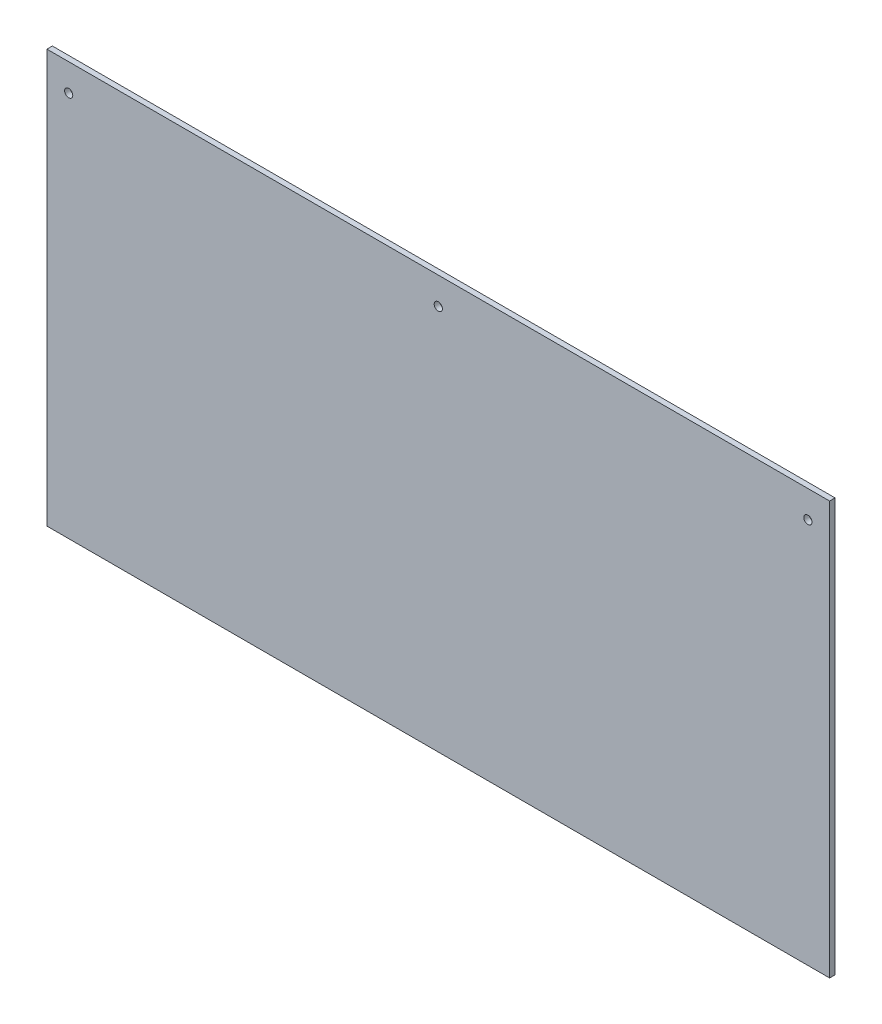
ISO-10303-21;
HEADER;
FILE_DESCRIPTION(('STEP AP214'),'2;1');
FILE_NAME('part.step','',(''),(''),'','','');
FILE_SCHEMA(('AUTOMOTIVE_DESIGN { 1 0 10303 214 1 1 1 1 }'));
ENDSEC;
DATA;
#1=APPLICATION_CONTEXT('core data for automotive mechanical design processes');
#2=APPLICATION_PROTOCOL_DEFINITION('international standard','automotive_design',2000,#1);
#3=PRODUCT_CONTEXT('',#1,'mechanical');
#4=PRODUCT('Part','Part','',(#3));
#5=PRODUCT_RELATED_PRODUCT_CATEGORY('part','',(#4));
#6=PRODUCT_DEFINITION_FORMATION('','',#4);
#7=PRODUCT_DEFINITION_CONTEXT('part definition',#1,'design');
#8=PRODUCT_DEFINITION('design','',#6,#7);
#9=PRODUCT_DEFINITION_SHAPE('','',#8);
#10=(LENGTH_UNIT() NAMED_UNIT(*) SI_UNIT(.MILLI.,.METRE.));
#11=(NAMED_UNIT(*) PLANE_ANGLE_UNIT() SI_UNIT($,.RADIAN.));
#12=(NAMED_UNIT(*) SI_UNIT($,.STERADIAN.) SOLID_ANGLE_UNIT());
#13=UNCERTAINTY_MEASURE_WITH_UNIT(LENGTH_MEASURE(1.E-05),#10,'distance_accuracy_value','');
#14=(GEOMETRIC_REPRESENTATION_CONTEXT(3) GLOBAL_UNCERTAINTY_ASSIGNED_CONTEXT((#13)) GLOBAL_UNIT_ASSIGNED_CONTEXT((#10,
#11,#12)) REPRESENTATION_CONTEXT('',''));
#15=CARTESIAN_POINT('',(0.,0.,0.));
#16=DIRECTION('',(0.,0.,1.));
#17=DIRECTION('',(1.,0.,0.));
#18=AXIS2_PLACEMENT_3D('',#15,#16,#17);
#19=CARTESIAN_POINT('',(889.,450.85,0.));
#20=DIRECTION('',(0.,0.,1.));
#21=DIRECTION('',(1.,0.,0.));
#22=AXIS2_PLACEMENT_3D('',#19,#20,#21);
#23=CYLINDRICAL_SURFACE('',#22,4.7625);
#24=CARTESIAN_POINT('',(889.,450.85,0.));
#25=DIRECTION('',(0.,0.,1.));
#26=DIRECTION('',(1.,0.,0.));
#27=AXIS2_PLACEMENT_3D('',#24,#25,#26);
#28=CIRCLE('',#27,4.7625);
#29=CARTESIAN_POINT('',(893.7625,450.85,0.));
#30=VERTEX_POINT('',#29);
#31=EDGE_CURVE('E42',#30,#30,#28,.T.);
#32=ORIENTED_EDGE('',*,*,#31,.F.);
#33=EDGE_LOOP('',(#32));
#34=FACE_BOUND('',#33,.T.);
#35=CARTESIAN_POINT('',(889.,450.85,6.35));
#36=DIRECTION('',(0.,0.,1.));
#37=DIRECTION('',(1.,0.,0.));
#38=AXIS2_PLACEMENT_3D('',#35,#36,#37);
#39=CIRCLE('',#38,4.7625);
#40=CARTESIAN_POINT('',(893.7625,450.85,6.35));
#41=VERTEX_POINT('',#40);
#42=EDGE_CURVE('E11',#41,#41,#39,.T.);
#43=ORIENTED_EDGE('',*,*,#42,.T.);
#44=EDGE_LOOP('',(#43));
#45=FACE_BOUND('',#44,.T.);
#46=ADVANCED_FACE('F34',(#34,#45),#23,.F.);
#47=CARTESIAN_POINT('',(0.,0.,6.35));
#48=DIRECTION('',(1.,0.,0.));
#49=DIRECTION('',(0.,0.,-1.));
#50=AXIS2_PLACEMENT_3D('',#47,#48,#49);
#51=PLANE('',#50);
#52=DIRECTION('',(0.,-1.,0.));
#53=VECTOR('',#52,1.);
#54=CARTESIAN_POINT('',(0.,0.,0.));
#55=LINE('',#54,#53);
#56=CARTESIAN_POINT('',(0.,482.6,0.));
#57=VERTEX_POINT('',#56);
#58=CARTESIAN_POINT('',(0.,0.,0.));
#59=VERTEX_POINT('',#58);
#60=EDGE_CURVE('E102',#57,#59,#55,.T.);
#61=ORIENTED_EDGE('',*,*,#60,.T.);
#62=DIRECTION('',(0.,0.,-1.));
#63=VECTOR('',#62,1.);
#64=CARTESIAN_POINT('',(0.,0.,6.35));
#65=LINE('',#64,#63);
#66=CARTESIAN_POINT('',(0.,0.,6.35));
#67=VERTEX_POINT('',#66);
#68=EDGE_CURVE('E93',#67,#59,#65,.T.);
#69=ORIENTED_EDGE('',*,*,#68,.F.);
#70=DIRECTION('',(0.,-1.,0.));
#71=VECTOR('',#70,1.);
#72=CARTESIAN_POINT('',(0.,0.,6.35));
#73=LINE('',#72,#71);
#74=CARTESIAN_POINT('',(0.,482.6,6.35));
#75=VERTEX_POINT('',#74);
#76=EDGE_CURVE('E87',#75,#67,#73,.T.);
#77=ORIENTED_EDGE('',*,*,#76,.F.);
#78=DIRECTION('',(0.,0.,-1.));
#79=VECTOR('',#78,1.);
#80=CARTESIAN_POINT('',(0.,482.6,6.35));
#81=LINE('',#80,#79);
#82=EDGE_CURVE('E98',#75,#57,#81,.T.);
#83=ORIENTED_EDGE('',*,*,#82,.T.);
#84=EDGE_LOOP('',(#61,#69,#77,#83));
#85=FACE_BOUND('',#84,.T.);
#86=ADVANCED_FACE('F118',(#85),#51,.F.);
#87=CARTESIAN_POINT('',(0.,0.,6.35));
#88=DIRECTION('',(0.,1.,0.));
#89=DIRECTION('',(0.,0.,1.));
#90=AXIS2_PLACEMENT_3D('',#87,#88,#89);
#91=PLANE('',#90);
#92=DIRECTION('',(1.,0.,0.));
#93=VECTOR('',#92,1.);
#94=CARTESIAN_POINT('',(0.,0.,0.));
#95=LINE('',#94,#93);
#96=CARTESIAN_POINT('',(914.4,0.,0.));
#97=VERTEX_POINT('',#96);
#98=EDGE_CURVE('E92',#59,#97,#95,.T.);
#99=ORIENTED_EDGE('',*,*,#98,.T.);
#100=DIRECTION('',(0.,0.,-1.));
#101=VECTOR('',#100,1.);
#102=CARTESIAN_POINT('',(914.4,0.,6.35));
#103=LINE('',#102,#101);
#104=CARTESIAN_POINT('',(914.4,0.,6.35));
#105=VERTEX_POINT('',#104);
#106=EDGE_CURVE('E90',#105,#97,#103,.T.);
#107=ORIENTED_EDGE('',*,*,#106,.F.);
#108=DIRECTION('',(1.,0.,0.));
#109=VECTOR('',#108,1.);
#110=CARTESIAN_POINT('',(0.,0.,6.35));
#111=LINE('',#110,#109);
#112=EDGE_CURVE('E81',#67,#105,#111,.T.);
#113=ORIENTED_EDGE('',*,*,#112,.F.);
#114=ORIENTED_EDGE('',*,*,#68,.T.);
#115=EDGE_LOOP('',(#99,#107,#113,#114));
#116=FACE_BOUND('',#115,.T.);
#117=ADVANCED_FACE('F91',(#116),#91,.F.);
#118=CARTESIAN_POINT('',(914.4,0.,6.35));
#119=DIRECTION('',(-1.,0.,0.));
#120=DIRECTION('',(0.,0.,1.));
#121=AXIS2_PLACEMENT_3D('',#118,#119,#120);
#122=PLANE('',#121);
#123=DIRECTION('',(0.,1.,0.));
#124=VECTOR('',#123,1.);
#125=CARTESIAN_POINT('',(914.4,0.,0.));
#126=LINE('',#125,#124);
#127=CARTESIAN_POINT('',(914.4,482.6,0.));
#128=VERTEX_POINT('',#127);
#129=EDGE_CURVE('E67',#97,#128,#126,.T.);
#130=ORIENTED_EDGE('',*,*,#129,.T.);
#131=DIRECTION('',(0.,0.,-1.));
#132=VECTOR('',#131,1.);
#133=CARTESIAN_POINT('',(914.4,482.6,6.35));
#134=LINE('',#133,#132);
#135=CARTESIAN_POINT('',(914.4,482.6,6.35));
#136=VERTEX_POINT('',#135);
#137=EDGE_CURVE('E94',#136,#128,#134,.T.);
#138=ORIENTED_EDGE('',*,*,#137,.F.);
#139=DIRECTION('',(0.,1.,0.));
#140=VECTOR('',#139,1.);
#141=CARTESIAN_POINT('',(914.4,0.,6.35));
#142=LINE('',#141,#140);
#143=EDGE_CURVE('E85',#105,#136,#142,.T.);
#144=ORIENTED_EDGE('',*,*,#143,.F.);
#145=ORIENTED_EDGE('',*,*,#106,.T.);
#146=EDGE_LOOP('',(#130,#138,#144,#145));
#147=FACE_BOUND('',#146,.T.);
#148=ADVANCED_FACE('F96',(#147),#122,.F.);
#149=CARTESIAN_POINT('',(0.,482.6,6.35));
#150=DIRECTION('',(0.,-1.,0.));
#151=DIRECTION('',(1.,0.,0.));
#152=AXIS2_PLACEMENT_3D('',#149,#150,#151);
#153=PLANE('',#152);
#154=DIRECTION('',(-1.,0.,0.));
#155=VECTOR('',#154,1.);
#156=CARTESIAN_POINT('',(0.,482.6,0.));
#157=LINE('',#156,#155);
#158=EDGE_CURVE('E73',#128,#57,#157,.T.);
#159=ORIENTED_EDGE('',*,*,#158,.T.);
#160=ORIENTED_EDGE('',*,*,#82,.F.);
#161=DIRECTION('',(-1.,0.,0.));
#162=VECTOR('',#161,1.);
#163=CARTESIAN_POINT('',(0.,482.6,6.35));
#164=LINE('',#163,#162);
#165=EDGE_CURVE('E50',#136,#75,#164,.T.);
#166=ORIENTED_EDGE('',*,*,#165,.F.);
#167=ORIENTED_EDGE('',*,*,#137,.T.);
#168=EDGE_LOOP('',(#159,#160,#166,#167));
#169=FACE_BOUND('',#168,.T.);
#170=ADVANCED_FACE('F121',(#169),#153,.F.);
#171=CARTESIAN_POINT('',(0.,0.,6.35));
#172=DIRECTION('',(0.,0.,-1.));
#173=DIRECTION('',(-1.,0.,0.));
#174=AXIS2_PLACEMENT_3D('',#171,#172,#173);
#175=PLANE('',#174);
#176=CARTESIAN_POINT('',(457.2,450.85,6.35));
#177=DIRECTION('',(0.,0.,1.));
#178=DIRECTION('',(1.,0.,0.));
#179=AXIS2_PLACEMENT_3D('',#176,#177,#178);
#180=CIRCLE('',#179,4.7625);
#181=CARTESIAN_POINT('',(461.9625,450.85,6.35));
#182=VERTEX_POINT('',#181);
#183=EDGE_CURVE('E150',#182,#182,#180,.T.);
#184=ORIENTED_EDGE('',*,*,#183,.F.);
#185=EDGE_LOOP('',(#184));
#186=FACE_BOUND('',#185,.T.);
#187=CARTESIAN_POINT('',(25.4,450.85,6.35));
#188=DIRECTION('',(0.,0.,1.));
#189=DIRECTION('',(1.,0.,0.));
#190=AXIS2_PLACEMENT_3D('',#187,#188,#189);
#191=CIRCLE('',#190,4.7625);
#192=CARTESIAN_POINT('',(30.1625,450.85,6.35));
#193=VERTEX_POINT('',#192);
#194=EDGE_CURVE('E147',#193,#193,#191,.T.);
#195=ORIENTED_EDGE('',*,*,#194,.F.);
#196=EDGE_LOOP('',(#195));
#197=FACE_BOUND('',#196,.T.);
#198=ORIENTED_EDGE('',*,*,#76,.T.);
#199=ORIENTED_EDGE('',*,*,#112,.T.);
#200=ORIENTED_EDGE('',*,*,#143,.T.);
#201=ORIENTED_EDGE('',*,*,#165,.T.);
#202=EDGE_LOOP('',(#198,#199,#200,#201));
#203=FACE_BOUND('',#202,.T.);
#204=ORIENTED_EDGE('',*,*,#42,.F.);
#205=EDGE_LOOP('',(#204));
#206=FACE_BOUND('',#205,.T.);
#207=ADVANCED_FACE('F82',(#186,#197,#203,#206),#175,.F.);
#208=CARTESIAN_POINT('',(0.,0.,0.));
#209=DIRECTION('',(0.,0.,-1.));
#210=DIRECTION('',(-1.,0.,0.));
#211=AXIS2_PLACEMENT_3D('',#208,#209,#210);
#212=PLANE('',#211);
#213=CARTESIAN_POINT('',(457.2,450.85,0.));
#214=DIRECTION('',(0.,0.,1.));
#215=DIRECTION('',(1.,0.,0.));
#216=AXIS2_PLACEMENT_3D('',#213,#214,#215);
#217=CIRCLE('',#216,4.7625);
#218=CARTESIAN_POINT('',(461.9625,450.85,0.));
#219=VERTEX_POINT('',#218);
#220=EDGE_CURVE('E155',#219,#219,#217,.T.);
#221=ORIENTED_EDGE('',*,*,#220,.T.);
#222=EDGE_LOOP('',(#221));
#223=FACE_BOUND('',#222,.T.);
#224=CARTESIAN_POINT('',(25.4,450.85,0.));
#225=DIRECTION('',(0.,0.,1.));
#226=DIRECTION('',(1.,0.,0.));
#227=AXIS2_PLACEMENT_3D('',#224,#225,#226);
#228=CIRCLE('',#227,4.7625);
#229=CARTESIAN_POINT('',(30.1625,450.85,0.));
#230=VERTEX_POINT('',#229);
#231=EDGE_CURVE('E105',#230,#230,#228,.T.);
#232=ORIENTED_EDGE('',*,*,#231,.T.);
#233=EDGE_LOOP('',(#232));
#234=FACE_BOUND('',#233,.T.);
#235=ORIENTED_EDGE('',*,*,#60,.F.);
#236=ORIENTED_EDGE('',*,*,#158,.F.);
#237=ORIENTED_EDGE('',*,*,#129,.F.);
#238=ORIENTED_EDGE('',*,*,#98,.F.);
#239=EDGE_LOOP('',(#235,#236,#237,#238));
#240=FACE_BOUND('',#239,.T.);
#241=ORIENTED_EDGE('',*,*,#31,.T.);
#242=EDGE_LOOP('',(#241));
#243=FACE_BOUND('',#242,.T.);
#244=ADVANCED_FACE('F114',(#223,#234,#240,#243),#212,.T.);
#245=CARTESIAN_POINT('',(25.4,450.85,0.));
#246=DIRECTION('',(0.,0.,1.));
#247=DIRECTION('',(1.,0.,0.));
#248=AXIS2_PLACEMENT_3D('',#245,#246,#247);
#249=CYLINDRICAL_SURFACE('',#248,4.7625);
#250=ORIENTED_EDGE('',*,*,#231,.F.);
#251=EDGE_LOOP('',(#250));
#252=FACE_BOUND('',#251,.T.);
#253=ORIENTED_EDGE('',*,*,#194,.T.);
#254=EDGE_LOOP('',(#253));
#255=FACE_BOUND('',#254,.T.);
#256=ADVANCED_FACE('F128',(#252,#255),#249,.F.);
#257=CARTESIAN_POINT('',(457.2,450.85,0.));
#258=DIRECTION('',(0.,0.,1.));
#259=DIRECTION('',(1.,0.,0.));
#260=AXIS2_PLACEMENT_3D('',#257,#258,#259);
#261=CYLINDRICAL_SURFACE('',#260,4.7625);
#262=ORIENTED_EDGE('',*,*,#220,.F.);
#263=EDGE_LOOP('',(#262));
#264=FACE_BOUND('',#263,.T.);
#265=ORIENTED_EDGE('',*,*,#183,.T.);
#266=EDGE_LOOP('',(#265));
#267=FACE_BOUND('',#266,.T.);
#268=ADVANCED_FACE('F160',(#264,#267),#261,.F.);
#269=CLOSED_SHELL('',(#46,#86,#117,#148,#170,#207,#244,#256,#268));
#270=MANIFOLD_SOLID_BREP('B2',#269);
#271=ADVANCED_BREP_SHAPE_REPRESENTATION('',(#18,#270),#14);
#272=SHAPE_DEFINITION_REPRESENTATION(#9,#271);
ENDSEC;
END-ISO-10303-21;
